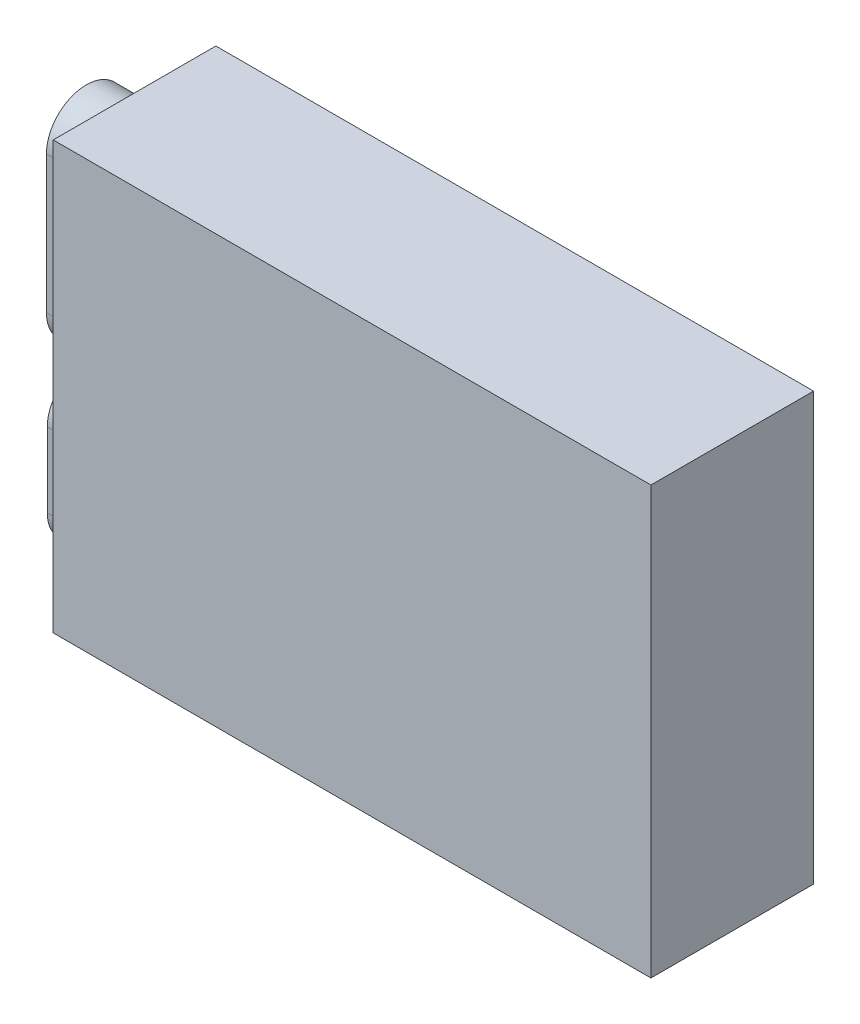
ISO-10303-21;
HEADER;
FILE_DESCRIPTION(('STEP AP214'),'2;1');
FILE_NAME('part.step','',(''),(''),'','','');
FILE_SCHEMA(('AUTOMOTIVE_DESIGN { 1 0 10303 214 1 1 1 1 }'));
ENDSEC;
DATA;
#1=APPLICATION_CONTEXT('core data for automotive mechanical design processes');
#2=APPLICATION_PROTOCOL_DEFINITION('international standard','automotive_design',2000,#1);
#3=PRODUCT_CONTEXT('',#1,'mechanical');
#4=PRODUCT('Part','Part','',(#3));
#5=PRODUCT_RELATED_PRODUCT_CATEGORY('part','',(#4));
#6=PRODUCT_DEFINITION_FORMATION('','',#4);
#7=PRODUCT_DEFINITION_CONTEXT('part definition',#1,'design');
#8=PRODUCT_DEFINITION('design','',#6,#7);
#9=PRODUCT_DEFINITION_SHAPE('','',#8);
#10=(LENGTH_UNIT() NAMED_UNIT(*) SI_UNIT(.MILLI.,.METRE.));
#11=(NAMED_UNIT(*) PLANE_ANGLE_UNIT() SI_UNIT($,.RADIAN.));
#12=(NAMED_UNIT(*) SI_UNIT($,.STERADIAN.) SOLID_ANGLE_UNIT());
#13=UNCERTAINTY_MEASURE_WITH_UNIT(LENGTH_MEASURE(1.E-05),#10,'distance_accuracy_value','');
#14=(GEOMETRIC_REPRESENTATION_CONTEXT(3) GLOBAL_UNCERTAINTY_ASSIGNED_CONTEXT((#13)) GLOBAL_UNIT_ASSIGNED_CONTEXT((#10,
#11,#12)) REPRESENTATION_CONTEXT('',''));
#15=CARTESIAN_POINT('',(0.,0.,0.));
#16=DIRECTION('',(0.,0.,1.));
#17=DIRECTION('',(1.,0.,0.));
#18=AXIS2_PLACEMENT_3D('',#15,#16,#17);
#19=CARTESIAN_POINT('',(-73.500000000001,-52.5000000000003,40.));
#20=DIRECTION('',(1.,0.,0.));
#21=DIRECTION('',(0.,0.,-1.));
#22=AXIS2_PLACEMENT_3D('',#19,#20,#21);
#23=PLANE('',#22);
#24=CARTESIAN_POINT('',(-73.500000000001,3.85949789173359,19.165513969355));
#25=DIRECTION('',(-1.,0.,0.));
#26=DIRECTION('',(0.,0.,1.));
#27=AXIS2_PLACEMENT_3D('',#24,#25,#26);
#28=CIRCLE('',#27,9.80521086007927);
#29=CARTESIAN_POINT('',(-73.500000000001,3.85949789173359,9.36030310927569));
#30=VERTEX_POINT('',#29);
#31=CARTESIAN_POINT('',(-73.500000000001,3.85949789173359,28.9707248294342));
#32=VERTEX_POINT('',#31);
#33=EDGE_CURVE('E262',#30,#32,#28,.T.);
#34=ORIENTED_EDGE('',*,*,#33,.F.);
#35=DIRECTION('',(0.,-1.,0.));
#36=VECTOR('',#35,1.);
#37=CARTESIAN_POINT('',(-73.500000000001,3.85949789173359,9.36030310927569));
#38=LINE('',#37,#36);
#39=CARTESIAN_POINT('',(-73.500000000001,37.6561821328578,9.36030310927569));
#40=VERTEX_POINT('',#39);
#41=EDGE_CURVE('E273',#40,#30,#38,.T.);
#42=ORIENTED_EDGE('',*,*,#41,.F.);
#43=CARTESIAN_POINT('',(-73.500000000001,37.6561821328578,19.165513969355));
#44=DIRECTION('',(-1.,0.,0.));
#45=DIRECTION('',(0.,0.,1.));
#46=AXIS2_PLACEMENT_3D('',#43,#44,#45);
#47=CIRCLE('',#46,9.80521086007927);
#48=CARTESIAN_POINT('',(-73.500000000001,37.6561821328578,28.9707248294342));
#49=VERTEX_POINT('',#48);
#50=EDGE_CURVE('E285',#49,#40,#47,.T.);
#51=ORIENTED_EDGE('',*,*,#50,.F.);
#52=DIRECTION('',(0.,1.,0.));
#53=VECTOR('',#52,1.);
#54=CARTESIAN_POINT('',(-73.500000000001,3.85949789173359,28.9707248294342));
#55=LINE('',#54,#53);
#56=EDGE_CURVE('E282',#32,#49,#55,.T.);
#57=ORIENTED_EDGE('',*,*,#56,.F.);
#58=EDGE_LOOP('',(#34,#42,#51,#57));
#59=FACE_BOUND('',#58,.T.);
#60=DIRECTION('',(0.,-1.,0.));
#61=VECTOR('',#60,1.);
#62=CARTESIAN_POINT('',(-73.500000000001,-52.5000000000003,0.));
#63=LINE('',#62,#61);
#64=CARTESIAN_POINT('',(-73.500000000001,52.4999999999997,0.));
#65=VERTEX_POINT('',#64);
#66=CARTESIAN_POINT('',(-73.500000000001,-52.5000000000003,0.));
#67=VERTEX_POINT('',#66);
#68=EDGE_CURVE('E301',#65,#67,#63,.T.);
#69=ORIENTED_EDGE('',*,*,#68,.T.);
#70=DIRECTION('',(0.,0.,-1.));
#71=VECTOR('',#70,1.);
#72=CARTESIAN_POINT('',(-73.500000000001,-52.5000000000003,40.));
#73=LINE('',#72,#71);
#74=CARTESIAN_POINT('',(-73.500000000001,-52.5000000000003,40.));
#75=VERTEX_POINT('',#74);
#76=EDGE_CURVE('E11',#75,#67,#73,.T.);
#77=ORIENTED_EDGE('',*,*,#76,.F.);
#78=DIRECTION('',(0.,-1.,0.));
#79=VECTOR('',#78,1.);
#80=CARTESIAN_POINT('',(-73.500000000001,-52.5000000000003,40.));
#81=LINE('',#80,#79);
#82=CARTESIAN_POINT('',(-73.500000000001,52.4999999999997,40.));
#83=VERTEX_POINT('',#82);
#84=EDGE_CURVE('E302',#83,#75,#81,.T.);
#85=ORIENTED_EDGE('',*,*,#84,.F.);
#86=DIRECTION('',(0.,0.,-1.));
#87=VECTOR('',#86,1.);
#88=CARTESIAN_POINT('',(-73.500000000001,52.4999999999997,40.));
#89=LINE('',#88,#87);
#90=EDGE_CURVE('E312',#83,#65,#89,.T.);
#91=ORIENTED_EDGE('',*,*,#90,.T.);
#92=EDGE_LOOP('',(#69,#77,#85,#91));
#93=FACE_BOUND('',#92,.T.);
#94=CARTESIAN_POINT('',(-73.500000000001,-38.9079111788249,19.5827569846775));
#95=DIRECTION('',(-1.,0.,0.));
#96=DIRECTION('',(0.,0.,1.));
#97=AXIS2_PLACEMENT_3D('',#94,#95,#96);
#98=CIRCLE('',#97,9.17934633709544);
#99=CARTESIAN_POINT('',(-73.500000000001,-38.9079111788249,10.403410647582));
#100=VERTEX_POINT('',#99);
#101=CARTESIAN_POINT('',(-73.500000000001,-38.9079111788249,28.7621033217729));
#102=VERTEX_POINT('',#101);
#103=EDGE_CURVE('E203',#100,#102,#98,.T.);
#104=ORIENTED_EDGE('',*,*,#103,.F.);
#105=DIRECTION('',(0.,-1.,0.));
#106=VECTOR('',#105,1.);
#107=CARTESIAN_POINT('',(-73.500000000001,-38.9079111788249,10.403410647582));
#108=LINE('',#107,#106);
#109=CARTESIAN_POINT('',(-73.500000000001,-20.5492185046339,10.403410647582));
#110=VERTEX_POINT('',#109);
#111=EDGE_CURVE('E211',#110,#100,#108,.T.);
#112=ORIENTED_EDGE('',*,*,#111,.F.);
#113=CARTESIAN_POINT('',(-73.500000000001,-20.5492185046339,19.5827569846775));
#114=DIRECTION('',(-1.,0.,0.));
#115=DIRECTION('',(0.,0.,1.));
#116=AXIS2_PLACEMENT_3D('',#113,#114,#115);
#117=CIRCLE('',#116,9.17934633709544);
#118=CARTESIAN_POINT('',(-73.500000000001,-20.5492185046339,28.7621033217729));
#119=VERTEX_POINT('',#118);
#120=EDGE_CURVE('E221',#119,#110,#117,.T.);
#121=ORIENTED_EDGE('',*,*,#120,.F.);
#122=DIRECTION('',(0.,1.,0.));
#123=VECTOR('',#122,1.);
#124=CARTESIAN_POINT('',(-73.500000000001,-38.9079111788249,28.7621033217729));
#125=LINE('',#124,#123);
#126=EDGE_CURVE('E54',#102,#119,#125,.T.);
#127=ORIENTED_EDGE('',*,*,#126,.F.);
#128=EDGE_LOOP('',(#104,#112,#121,#127));
#129=FACE_BOUND('',#128,.T.);
#130=ADVANCED_FACE('F32',(#59,#93,#129),#23,.F.);
#131=CARTESIAN_POINT('',(73.4999999999988,-52.5000000000002,40.));
#132=DIRECTION('',(0.,1.,0.));
#133=DIRECTION('',(-1.,0.,0.));
#134=AXIS2_PLACEMENT_3D('',#131,#132,#133);
#135=PLANE('',#134);
#136=DIRECTION('',(1.,0.,0.));
#137=VECTOR('',#136,1.);
#138=CARTESIAN_POINT('',(73.4999999999988,-52.5000000000002,0.));
#139=LINE('',#138,#137);
#140=CARTESIAN_POINT('',(73.4999999999988,-52.5000000000002,0.));
#141=VERTEX_POINT('',#140);
#142=EDGE_CURVE('E315',#67,#141,#139,.T.);
#143=ORIENTED_EDGE('',*,*,#142,.T.);
#144=DIRECTION('',(0.,0.,-1.));
#145=VECTOR('',#144,1.);
#146=CARTESIAN_POINT('',(73.4999999999988,-52.5000000000002,40.));
#147=LINE('',#146,#145);
#148=CARTESIAN_POINT('',(73.4999999999988,-52.5000000000002,40.));
#149=VERTEX_POINT('',#148);
#150=EDGE_CURVE('E39',#149,#141,#147,.T.);
#151=ORIENTED_EDGE('',*,*,#150,.F.);
#152=DIRECTION('',(1.,0.,0.));
#153=VECTOR('',#152,1.);
#154=CARTESIAN_POINT('',(73.4999999999988,-52.5000000000002,40.));
#155=LINE('',#154,#153);
#156=EDGE_CURVE('E305',#75,#149,#155,.T.);
#157=ORIENTED_EDGE('',*,*,#156,.F.);
#158=ORIENTED_EDGE('',*,*,#76,.T.);
#159=EDGE_LOOP('',(#143,#151,#157,#158));
#160=FACE_BOUND('',#159,.T.);
#161=ADVANCED_FACE('F345',(#160),#135,.F.);
#162=CARTESIAN_POINT('',(73.4999999999988,-52.5000000000002,40.));
#163=DIRECTION('',(-1.,0.,0.));
#164=DIRECTION('',(0.,0.,1.));
#165=AXIS2_PLACEMENT_3D('',#162,#163,#164);
#166=PLANE('',#165);
#167=DIRECTION('',(0.,1.,0.));
#168=VECTOR('',#167,1.);
#169=CARTESIAN_POINT('',(73.4999999999988,-52.5000000000002,0.));
#170=LINE('',#169,#168);
#171=CARTESIAN_POINT('',(73.4999999999988,52.4999999999998,0.));
#172=VERTEX_POINT('',#171);
#173=EDGE_CURVE('E317',#141,#172,#170,.T.);
#174=ORIENTED_EDGE('',*,*,#173,.T.);
#175=DIRECTION('',(0.,0.,-1.));
#176=VECTOR('',#175,1.);
#177=CARTESIAN_POINT('',(73.4999999999988,52.4999999999998,40.));
#178=LINE('',#177,#176);
#179=CARTESIAN_POINT('',(73.4999999999988,52.4999999999998,40.));
#180=VERTEX_POINT('',#179);
#181=EDGE_CURVE('E322',#180,#172,#178,.T.);
#182=ORIENTED_EDGE('',*,*,#181,.F.);
#183=DIRECTION('',(0.,1.,0.));
#184=VECTOR('',#183,1.);
#185=CARTESIAN_POINT('',(73.4999999999988,-52.5000000000002,40.));
#186=LINE('',#185,#184);
#187=EDGE_CURVE('E308',#149,#180,#186,.T.);
#188=ORIENTED_EDGE('',*,*,#187,.F.);
#189=ORIENTED_EDGE('',*,*,#150,.T.);
#190=EDGE_LOOP('',(#174,#182,#188,#189));
#191=FACE_BOUND('',#190,.T.);
#192=ADVANCED_FACE('F329',(#191),#166,.F.);
#193=CARTESIAN_POINT('',(73.4999999999988,52.4999999999998,40.));
#194=DIRECTION('',(0.,-1.,0.));
#195=DIRECTION('',(1.,0.,0.));
#196=AXIS2_PLACEMENT_3D('',#193,#194,#195);
#197=PLANE('',#196);
#198=DIRECTION('',(-1.,0.,0.));
#199=VECTOR('',#198,1.);
#200=CARTESIAN_POINT('',(73.4999999999988,52.4999999999998,0.));
#201=LINE('',#200,#199);
#202=EDGE_CURVE('E306',#172,#65,#201,.T.);
#203=ORIENTED_EDGE('',*,*,#202,.T.);
#204=ORIENTED_EDGE('',*,*,#90,.F.);
#205=DIRECTION('',(-1.,0.,0.));
#206=VECTOR('',#205,1.);
#207=CARTESIAN_POINT('',(73.4999999999988,52.4999999999998,40.));
#208=LINE('',#207,#206);
#209=EDGE_CURVE('E310',#180,#83,#208,.T.);
#210=ORIENTED_EDGE('',*,*,#209,.F.);
#211=ORIENTED_EDGE('',*,*,#181,.T.);
#212=EDGE_LOOP('',(#203,#204,#210,#211));
#213=FACE_BOUND('',#212,.T.);
#214=ADVANCED_FACE('F338',(#213),#197,.F.);
#215=CARTESIAN_POINT('',(0.,0.,40.));
#216=DIRECTION('',(0.,0.,1.));
#217=DIRECTION('',(1.,0.,0.));
#218=AXIS2_PLACEMENT_3D('',#215,#216,#217);
#219=PLANE('',#218);
#220=ORIENTED_EDGE('',*,*,#84,.T.);
#221=ORIENTED_EDGE('',*,*,#156,.T.);
#222=ORIENTED_EDGE('',*,*,#187,.T.);
#223=ORIENTED_EDGE('',*,*,#209,.T.);
#224=EDGE_LOOP('',(#220,#221,#222,#223));
#225=FACE_BOUND('',#224,.T.);
#226=ADVANCED_FACE('F344',(#225),#219,.T.);
#227=CARTESIAN_POINT('',(0.,0.,0.));
#228=DIRECTION('',(0.,0.,1.));
#229=DIRECTION('',(1.,0.,0.));
#230=AXIS2_PLACEMENT_3D('',#227,#228,#229);
#231=PLANE('',#230);
#232=ORIENTED_EDGE('',*,*,#68,.F.);
#233=ORIENTED_EDGE('',*,*,#202,.F.);
#234=ORIENTED_EDGE('',*,*,#173,.F.);
#235=ORIENTED_EDGE('',*,*,#142,.F.);
#236=EDGE_LOOP('',(#232,#233,#234,#235));
#237=FACE_BOUND('',#236,.T.);
#238=ADVANCED_FACE('F335',(#237),#231,.F.);
#239=CARTESIAN_POINT('',(-86.200000000001,3.85949789173359,19.165513969355));
#240=DIRECTION('',(1.,0.,0.));
#241=DIRECTION('',(0.,0.,-1.));
#242=AXIS2_PLACEMENT_3D('',#239,#240,#241);
#243=CYLINDRICAL_SURFACE('',#242,9.80521086007927);
#244=ORIENTED_EDGE('',*,*,#33,.T.);
#245=DIRECTION('',(1.,0.,0.));
#246=VECTOR('',#245,1.);
#247=CARTESIAN_POINT('',(-86.200000000001,3.85949789173359,28.9707248294342));
#248=LINE('',#247,#246);
#249=CARTESIAN_POINT('',(-86.200000000001,3.85949789173359,28.9707248294342));
#250=VERTEX_POINT('',#249);
#251=EDGE_CURVE('E298',#250,#32,#248,.T.);
#252=ORIENTED_EDGE('',*,*,#251,.F.);
#253=CARTESIAN_POINT('',(-86.200000000001,3.85949789173359,19.165513969355));
#254=DIRECTION('',(-1.,0.,0.));
#255=DIRECTION('',(0.,0.,1.));
#256=AXIS2_PLACEMENT_3D('',#253,#254,#255);
#257=CIRCLE('',#256,9.80521086007927);
#258=CARTESIAN_POINT('',(-86.200000000001,3.85949789173359,9.36030310927569));
#259=VERTEX_POINT('',#258);
#260=EDGE_CURVE('E269',#259,#250,#257,.T.);
#261=ORIENTED_EDGE('',*,*,#260,.F.);
#262=DIRECTION('',(1.,0.,0.));
#263=VECTOR('',#262,1.);
#264=CARTESIAN_POINT('',(-86.200000000001,3.85949789173359,9.36030310927569));
#265=LINE('',#264,#263);
#266=EDGE_CURVE('E279',#259,#30,#265,.T.);
#267=ORIENTED_EDGE('',*,*,#266,.T.);
#268=EDGE_LOOP('',(#244,#252,#261,#267));
#269=FACE_BOUND('',#268,.T.);
#270=ADVANCED_FACE('F358',(#269),#243,.T.);
#271=CARTESIAN_POINT('',(-86.200000000001,3.85949789173359,28.9707248294342));
#272=DIRECTION('',(0.,0.,-1.));
#273=DIRECTION('',(-1.,0.,0.));
#274=AXIS2_PLACEMENT_3D('',#271,#272,#273);
#275=PLANE('',#274);
#276=ORIENTED_EDGE('',*,*,#56,.T.);
#277=DIRECTION('',(1.,0.,0.));
#278=VECTOR('',#277,1.);
#279=CARTESIAN_POINT('',(-86.200000000001,37.6561821328578,28.9707248294342));
#280=LINE('',#279,#278);
#281=CARTESIAN_POINT('',(-86.200000000001,37.6561821328578,28.9707248294342));
#282=VERTEX_POINT('',#281);
#283=EDGE_CURVE('E295',#282,#49,#280,.T.);
#284=ORIENTED_EDGE('',*,*,#283,.F.);
#285=DIRECTION('',(0.,1.,0.));
#286=VECTOR('',#285,1.);
#287=CARTESIAN_POINT('',(-86.200000000001,3.85949789173359,28.9707248294342));
#288=LINE('',#287,#286);
#289=EDGE_CURVE('E272',#250,#282,#288,.T.);
#290=ORIENTED_EDGE('',*,*,#289,.F.);
#291=ORIENTED_EDGE('',*,*,#251,.T.);
#292=EDGE_LOOP('',(#276,#284,#290,#291));
#293=FACE_BOUND('',#292,.T.);
#294=ADVANCED_FACE('F363',(#293),#275,.F.);
#295=CARTESIAN_POINT('',(-86.200000000001,37.6561821328578,19.165513969355));
#296=DIRECTION('',(1.,0.,0.));
#297=DIRECTION('',(0.,0.,-1.));
#298=AXIS2_PLACEMENT_3D('',#295,#296,#297);
#299=CYLINDRICAL_SURFACE('',#298,9.80521086007927);
#300=ORIENTED_EDGE('',*,*,#50,.T.);
#301=DIRECTION('',(1.,0.,0.));
#302=VECTOR('',#301,1.);
#303=CARTESIAN_POINT('',(-86.200000000001,37.6561821328578,9.36030310927569));
#304=LINE('',#303,#302);
#305=CARTESIAN_POINT('',(-86.200000000001,37.6561821328578,9.36030310927569));
#306=VERTEX_POINT('',#305);
#307=EDGE_CURVE('E292',#306,#40,#304,.T.);
#308=ORIENTED_EDGE('',*,*,#307,.F.);
#309=CARTESIAN_POINT('',(-86.200000000001,37.6561821328578,19.165513969355));
#310=DIRECTION('',(-1.,0.,0.));
#311=DIRECTION('',(0.,0.,1.));
#312=AXIS2_PLACEMENT_3D('',#309,#310,#311);
#313=CIRCLE('',#312,9.80521086007927);
#314=EDGE_CURVE('E275',#282,#306,#313,.T.);
#315=ORIENTED_EDGE('',*,*,#314,.F.);
#316=ORIENTED_EDGE('',*,*,#283,.T.);
#317=EDGE_LOOP('',(#300,#308,#315,#316));
#318=FACE_BOUND('',#317,.T.);
#319=ADVANCED_FACE('F367',(#318),#299,.T.);
#320=CARTESIAN_POINT('',(-86.200000000001,3.85949789173359,9.36030310927569));
#321=DIRECTION('',(0.,0.,1.));
#322=DIRECTION('',(1.,0.,0.));
#323=AXIS2_PLACEMENT_3D('',#320,#321,#322);
#324=PLANE('',#323);
#325=ORIENTED_EDGE('',*,*,#41,.T.);
#326=ORIENTED_EDGE('',*,*,#266,.F.);
#327=DIRECTION('',(0.,-1.,0.));
#328=VECTOR('',#327,1.);
#329=CARTESIAN_POINT('',(-86.200000000001,3.85949789173359,9.36030310927569));
#330=LINE('',#329,#328);
#331=EDGE_CURVE('E277',#306,#259,#330,.T.);
#332=ORIENTED_EDGE('',*,*,#331,.F.);
#333=ORIENTED_EDGE('',*,*,#307,.T.);
#334=EDGE_LOOP('',(#325,#326,#332,#333));
#335=FACE_BOUND('',#334,.T.);
#336=ADVANCED_FACE('F371',(#335),#324,.F.);
#337=CARTESIAN_POINT('',(-86.200000000001,3.85949789173359,19.165513969355));
#338=DIRECTION('',(-1.,0.,0.));
#339=DIRECTION('',(0.,0.,1.));
#340=AXIS2_PLACEMENT_3D('',#337,#338,#339);
#341=PLANE('',#340);
#342=CARTESIAN_POINT('',(-86.200000000001,3.85949789173359,19.569921541134));
#343=DIRECTION('',(-1.,0.,0.));
#344=DIRECTION('',(0.,0.,1.));
#345=AXIS2_PLACEMENT_3D('',#342,#343,#344);
#346=CIRCLE('',#345,7.41605218116661);
#347=CARTESIAN_POINT('',(-86.200000000001,3.77076454303128,12.1544002279279));
#348=VERTEX_POINT('',#347);
#349=CARTESIAN_POINT('',(-86.200000000001,3.9482312404359,26.9854428543401));
#350=VERTEX_POINT('',#349);
#351=EDGE_CURVE('E236',#348,#350,#346,.T.);
#352=ORIENTED_EDGE('',*,*,#351,.F.);
#353=DIRECTION('',(0.,-0.999928416366615,0.01196503834313));
#354=VECTOR('',#353,1.);
#355=CARTESIAN_POINT('',(-86.200000000001,3.77076454303128,12.1544002279279));
#356=LINE('',#355,#354);
#357=CARTESIAN_POINT('',(-86.200000000001,37.5674487841555,11.7499926561488));
#358=VERTEX_POINT('',#357);
#359=EDGE_CURVE('E241',#358,#348,#356,.T.);
#360=ORIENTED_EDGE('',*,*,#359,.F.);
#361=CARTESIAN_POINT('',(-86.200000000001,37.6561821328578,19.165513969355));
#362=DIRECTION('',(-1.,0.,0.));
#363=DIRECTION('',(0.,0.,1.));
#364=AXIS2_PLACEMENT_3D('',#361,#362,#363);
#365=CIRCLE('',#364,7.41605218116661);
#366=CARTESIAN_POINT('',(-86.200000000001,37.7449154815601,26.5810352825611));
#367=VERTEX_POINT('',#366);
#368=EDGE_CURVE('E255',#367,#358,#365,.T.);
#369=ORIENTED_EDGE('',*,*,#368,.F.);
#370=DIRECTION('',(0.,0.999928416366615,-0.01196503834313));
#371=VECTOR('',#370,1.);
#372=CARTESIAN_POINT('',(-86.200000000001,3.9482312404359,26.9854428543401));
#373=LINE('',#372,#371);
#374=EDGE_CURVE('E252',#350,#367,#373,.T.);
#375=ORIENTED_EDGE('',*,*,#374,.F.);
#376=EDGE_LOOP('',(#352,#360,#369,#375));
#377=FACE_BOUND('',#376,.T.);
#378=ORIENTED_EDGE('',*,*,#260,.T.);
#379=ORIENTED_EDGE('',*,*,#289,.T.);
#380=ORIENTED_EDGE('',*,*,#314,.T.);
#381=ORIENTED_EDGE('',*,*,#331,.T.);
#382=EDGE_LOOP('',(#378,#379,#380,#381));
#383=FACE_BOUND('',#382,.T.);
#384=ADVANCED_FACE('F375',(#377,#383),#341,.T.);
#385=CARTESIAN_POINT('',(-76.040000000001,3.85949789173359,19.569921541134));
#386=DIRECTION('',(-1.,0.,0.));
#387=DIRECTION('',(0.,0.,1.));
#388=AXIS2_PLACEMENT_3D('',#385,#386,#387);
#389=CYLINDRICAL_SURFACE('',#388,7.41605218116661);
#390=ORIENTED_EDGE('',*,*,#351,.T.);
#391=DIRECTION('',(-1.,0.,0.));
#392=VECTOR('',#391,1.);
#393=CARTESIAN_POINT('',(-76.040000000001,3.9482312404359,26.9854428543401));
#394=LINE('',#393,#392);
#395=CARTESIAN_POINT('',(-76.040000000001,3.9482312404359,26.9854428543401));
#396=VERTEX_POINT('',#395);
#397=EDGE_CURVE('E250',#396,#350,#394,.T.);
#398=ORIENTED_EDGE('',*,*,#397,.F.);
#399=CARTESIAN_POINT('',(-76.040000000001,3.85949789173359,19.569921541134));
#400=DIRECTION('',(-1.,0.,0.));
#401=DIRECTION('',(0.,0.,1.));
#402=AXIS2_PLACEMENT_3D('',#399,#400,#401);
#403=CIRCLE('',#402,7.41605218116661);
#404=CARTESIAN_POINT('',(-76.040000000001,3.77076454303128,12.1544002279279));
#405=VERTEX_POINT('',#404);
#406=EDGE_CURVE('E237',#405,#396,#403,.T.);
#407=ORIENTED_EDGE('',*,*,#406,.F.);
#408=DIRECTION('',(-1.,0.,0.));
#409=VECTOR('',#408,1.);
#410=CARTESIAN_POINT('',(-76.040000000001,3.77076454303128,12.1544002279279));
#411=LINE('',#410,#409);
#412=EDGE_CURVE('E260',#405,#348,#411,.T.);
#413=ORIENTED_EDGE('',*,*,#412,.T.);
#414=EDGE_LOOP('',(#390,#398,#407,#413));
#415=FACE_BOUND('',#414,.T.);
#416=ADVANCED_FACE('F379',(#415),#389,.F.);
#417=CARTESIAN_POINT('',(-76.040000000001,3.77076454303128,12.1544002279279));
#418=DIRECTION('',(0.,-0.01196503834313,-0.999928416366615));
#419=DIRECTION('',(0.,0.999928416366615,-0.01196503834313));
#420=AXIS2_PLACEMENT_3D('',#417,#418,#419);
#421=PLANE('',#420);
#422=ORIENTED_EDGE('',*,*,#359,.T.);
#423=ORIENTED_EDGE('',*,*,#412,.F.);
#424=DIRECTION('',(0.,-0.999928416366615,0.01196503834313));
#425=VECTOR('',#424,1.);
#426=CARTESIAN_POINT('',(-76.040000000001,3.77076454303128,12.1544002279279));
#427=LINE('',#426,#425);
#428=CARTESIAN_POINT('',(-76.040000000001,37.5674487841555,11.7499926561488));
#429=VERTEX_POINT('',#428);
#430=EDGE_CURVE('E247',#429,#405,#427,.T.);
#431=ORIENTED_EDGE('',*,*,#430,.F.);
#432=DIRECTION('',(-1.,0.,0.));
#433=VECTOR('',#432,1.);
#434=CARTESIAN_POINT('',(-76.040000000001,37.5674487841555,11.7499926561488));
#435=LINE('',#434,#433);
#436=EDGE_CURVE('E263',#429,#358,#435,.T.);
#437=ORIENTED_EDGE('',*,*,#436,.T.);
#438=EDGE_LOOP('',(#422,#423,#431,#437));
#439=FACE_BOUND('',#438,.T.);
#440=ADVANCED_FACE('F383',(#439),#421,.F.);
#441=CARTESIAN_POINT('',(-76.040000000001,37.6561821328578,19.165513969355));
#442=DIRECTION('',(-1.,0.,0.));
#443=DIRECTION('',(0.,0.,1.));
#444=AXIS2_PLACEMENT_3D('',#441,#442,#443);
#445=CYLINDRICAL_SURFACE('',#444,7.41605218116661);
#446=ORIENTED_EDGE('',*,*,#368,.T.);
#447=ORIENTED_EDGE('',*,*,#436,.F.);
#448=CARTESIAN_POINT('',(-76.040000000001,37.6561821328578,19.165513969355));
#449=DIRECTION('',(-1.,0.,0.));
#450=DIRECTION('',(0.,0.,1.));
#451=AXIS2_PLACEMENT_3D('',#448,#449,#450);
#452=CIRCLE('',#451,7.41605218116661);
#453=CARTESIAN_POINT('',(-76.040000000001,37.7449154815601,26.5810352825611));
#454=VERTEX_POINT('',#453);
#455=EDGE_CURVE('E244',#454,#429,#452,.T.);
#456=ORIENTED_EDGE('',*,*,#455,.F.);
#457=DIRECTION('',(-1.,0.,0.));
#458=VECTOR('',#457,1.);
#459=CARTESIAN_POINT('',(-76.040000000001,37.7449154815601,26.5810352825611));
#460=LINE('',#459,#458);
#461=EDGE_CURVE('E265',#454,#367,#460,.T.);
#462=ORIENTED_EDGE('',*,*,#461,.T.);
#463=EDGE_LOOP('',(#446,#447,#456,#462));
#464=FACE_BOUND('',#463,.T.);
#465=ADVANCED_FACE('F389',(#464),#445,.F.);
#466=CARTESIAN_POINT('',(-76.040000000001,3.9482312404359,26.9854428543401));
#467=DIRECTION('',(0.,0.01196503834313,0.999928416366615));
#468=DIRECTION('',(0.,-0.999928416366615,0.01196503834313));
#469=AXIS2_PLACEMENT_3D('',#466,#467,#468);
#470=PLANE('',#469);
#471=ORIENTED_EDGE('',*,*,#374,.T.);
#472=ORIENTED_EDGE('',*,*,#461,.F.);
#473=DIRECTION('',(0.,0.999928416366615,-0.01196503834313));
#474=VECTOR('',#473,1.);
#475=CARTESIAN_POINT('',(-76.040000000001,3.9482312404359,26.9854428543401));
#476=LINE('',#475,#474);
#477=EDGE_CURVE('E240',#396,#454,#476,.T.);
#478=ORIENTED_EDGE('',*,*,#477,.F.);
#479=ORIENTED_EDGE('',*,*,#397,.T.);
#480=EDGE_LOOP('',(#471,#472,#478,#479));
#481=FACE_BOUND('',#480,.T.);
#482=ADVANCED_FACE('F385',(#481),#470,.F.);
#483=CARTESIAN_POINT('',(-76.040000000001,3.85949789173359,19.569921541134));
#484=DIRECTION('',(-1.,0.,0.));
#485=DIRECTION('',(0.,0.,1.));
#486=AXIS2_PLACEMENT_3D('',#483,#484,#485);
#487=PLANE('',#486);
#488=ORIENTED_EDGE('',*,*,#406,.T.);
#489=ORIENTED_EDGE('',*,*,#477,.T.);
#490=ORIENTED_EDGE('',*,*,#455,.T.);
#491=ORIENTED_EDGE('',*,*,#430,.T.);
#492=EDGE_LOOP('',(#488,#489,#490,#491));
#493=FACE_BOUND('',#492,.T.);
#494=ADVANCED_FACE('F388',(#493),#487,.T.);
#495=CARTESIAN_POINT('',(-86.200000000001,-38.9079111788249,19.5827569846775));
#496=DIRECTION('',(1.,0.,0.));
#497=DIRECTION('',(0.,0.,-1.));
#498=AXIS2_PLACEMENT_3D('',#495,#496,#497);
#499=CYLINDRICAL_SURFACE('',#498,9.17934633709544);
#500=ORIENTED_EDGE('',*,*,#103,.T.);
#501=DIRECTION('',(1.,0.,0.));
#502=VECTOR('',#501,1.);
#503=CARTESIAN_POINT('',(-86.200000000001,-38.9079111788249,28.7621033217729));
#504=LINE('',#503,#502);
#505=CARTESIAN_POINT('',(-86.200000000001,-38.9079111788249,28.7621033217729));
#506=VERTEX_POINT('',#505);
#507=EDGE_CURVE('E234',#506,#102,#504,.T.);
#508=ORIENTED_EDGE('',*,*,#507,.F.);
#509=CARTESIAN_POINT('',(-86.200000000001,-38.9079111788249,19.5827569846775));
#510=DIRECTION('',(-1.,0.,0.));
#511=DIRECTION('',(0.,0.,1.));
#512=AXIS2_PLACEMENT_3D('',#509,#510,#511);
#513=CIRCLE('',#512,9.17934633709544);
#514=CARTESIAN_POINT('',(-86.200000000001,-38.9079111788249,10.403410647582));
#515=VERTEX_POINT('',#514);
#516=EDGE_CURVE('E207',#515,#506,#513,.T.);
#517=ORIENTED_EDGE('',*,*,#516,.F.);
#518=DIRECTION('',(1.,0.,0.));
#519=VECTOR('',#518,1.);
#520=CARTESIAN_POINT('',(-86.200000000001,-38.9079111788249,10.403410647582));
#521=LINE('',#520,#519);
#522=EDGE_CURVE('E217',#515,#100,#521,.T.);
#523=ORIENTED_EDGE('',*,*,#522,.T.);
#524=EDGE_LOOP('',(#500,#508,#517,#523));
#525=FACE_BOUND('',#524,.T.);
#526=ADVANCED_FACE('F399',(#525),#499,.T.);
#527=CARTESIAN_POINT('',(-86.200000000001,-38.9079111788249,28.7621033217729));
#528=DIRECTION('',(0.,0.,-1.));
#529=DIRECTION('',(-1.,0.,0.));
#530=AXIS2_PLACEMENT_3D('',#527,#528,#529);
#531=PLANE('',#530);
#532=ORIENTED_EDGE('',*,*,#126,.T.);
#533=DIRECTION('',(1.,0.,0.));
#534=VECTOR('',#533,1.);
#535=CARTESIAN_POINT('',(-86.200000000001,-20.5492185046339,28.7621033217729));
#536=LINE('',#535,#534);
#537=CARTESIAN_POINT('',(-86.200000000001,-20.5492185046339,28.7621033217729));
#538=VERTEX_POINT('',#537);
#539=EDGE_CURVE('E231',#538,#119,#536,.T.);
#540=ORIENTED_EDGE('',*,*,#539,.F.);
#541=DIRECTION('',(0.,1.,0.));
#542=VECTOR('',#541,1.);
#543=CARTESIAN_POINT('',(-86.200000000001,-38.9079111788249,28.7621033217729));
#544=LINE('',#543,#542);
#545=EDGE_CURVE('E210',#506,#538,#544,.T.);
#546=ORIENTED_EDGE('',*,*,#545,.F.);
#547=ORIENTED_EDGE('',*,*,#507,.T.);
#548=EDGE_LOOP('',(#532,#540,#546,#547));
#549=FACE_BOUND('',#548,.T.);
#550=ADVANCED_FACE('F403',(#549),#531,.F.);
#551=CARTESIAN_POINT('',(-86.200000000001,-20.5492185046339,19.5827569846775));
#552=DIRECTION('',(1.,0.,0.));
#553=DIRECTION('',(0.,0.,-1.));
#554=AXIS2_PLACEMENT_3D('',#551,#552,#553);
#555=CYLINDRICAL_SURFACE('',#554,9.17934633709544);
#556=ORIENTED_EDGE('',*,*,#120,.T.);
#557=DIRECTION('',(1.,0.,0.));
#558=VECTOR('',#557,1.);
#559=CARTESIAN_POINT('',(-86.200000000001,-20.5492185046339,10.403410647582));
#560=LINE('',#559,#558);
#561=CARTESIAN_POINT('',(-86.200000000001,-20.5492185046339,10.403410647582));
#562=VERTEX_POINT('',#561);
#563=EDGE_CURVE('E228',#562,#110,#560,.T.);
#564=ORIENTED_EDGE('',*,*,#563,.F.);
#565=CARTESIAN_POINT('',(-86.200000000001,-20.5492185046339,19.5827569846775));
#566=DIRECTION('',(-1.,0.,0.));
#567=DIRECTION('',(0.,0.,1.));
#568=AXIS2_PLACEMENT_3D('',#565,#566,#567);
#569=CIRCLE('',#568,9.17934633709544);
#570=EDGE_CURVE('E213',#538,#562,#569,.T.);
#571=ORIENTED_EDGE('',*,*,#570,.F.);
#572=ORIENTED_EDGE('',*,*,#539,.T.);
#573=EDGE_LOOP('',(#556,#564,#571,#572));
#574=FACE_BOUND('',#573,.T.);
#575=ADVANCED_FACE('F407',(#574),#555,.T.);
#576=CARTESIAN_POINT('',(-86.200000000001,-38.9079111788249,10.403410647582));
#577=DIRECTION('',(0.,0.,1.));
#578=DIRECTION('',(1.,0.,0.));
#579=AXIS2_PLACEMENT_3D('',#576,#577,#578);
#580=PLANE('',#579);
#581=ORIENTED_EDGE('',*,*,#111,.T.);
#582=ORIENTED_EDGE('',*,*,#522,.F.);
#583=DIRECTION('',(0.,-1.,0.));
#584=VECTOR('',#583,1.);
#585=CARTESIAN_POINT('',(-86.200000000001,-38.9079111788249,10.403410647582));
#586=LINE('',#585,#584);
#587=EDGE_CURVE('E215',#562,#515,#586,.T.);
#588=ORIENTED_EDGE('',*,*,#587,.F.);
#589=ORIENTED_EDGE('',*,*,#563,.T.);
#590=EDGE_LOOP('',(#581,#582,#588,#589));
#591=FACE_BOUND('',#590,.T.);
#592=ADVANCED_FACE('F411',(#591),#580,.F.);
#593=CARTESIAN_POINT('',(-86.200000000001,-38.9079111788249,19.5827569846775));
#594=DIRECTION('',(-1.,0.,0.));
#595=DIRECTION('',(0.,0.,1.));
#596=AXIS2_PLACEMENT_3D('',#593,#594,#595);
#597=PLANE('',#596);
#598=CARTESIAN_POINT('',(-86.200000000001,-38.9079111788249,19.6344692603229));
#599=DIRECTION('',(-1.,0.,0.));
#600=DIRECTION('',(0.,0.,1.));
#601=AXIS2_PLACEMENT_3D('',#598,#599,#600);
#602=CIRCLE('',#601,7.24622437330428);
#603=CARTESIAN_POINT('',(-86.200000000001,-38.928322069311,12.3882736333874));
#604=VERTEX_POINT('',#603);
#605=CARTESIAN_POINT('',(-86.200000000001,-38.8875002883388,26.8806648872583));
#606=VERTEX_POINT('',#605);
#607=EDGE_CURVE('E46',#604,#606,#602,.T.);
#608=ORIENTED_EDGE('',*,*,#607,.F.);
#609=DIRECTION('',(0.,-0.999996032917649,0.00281676214185156));
#610=VECTOR('',#609,1.);
#611=CARTESIAN_POINT('',(-86.200000000001,-38.928322069311,12.3882736333874));
#612=LINE('',#611,#610);
#613=CARTESIAN_POINT('',(-86.200000000001,-20.56962939512,12.336561357742));
#614=VERTEX_POINT('',#613);
#615=EDGE_CURVE('E188',#614,#604,#612,.T.);
#616=ORIENTED_EDGE('',*,*,#615,.F.);
#617=CARTESIAN_POINT('',(-86.200000000001,-20.5492185046339,19.5827569846775));
#618=DIRECTION('',(-1.,0.,0.));
#619=DIRECTION('',(0.,0.,1.));
#620=AXIS2_PLACEMENT_3D('',#617,#618,#619);
#621=CIRCLE('',#620,7.24622437330428);
#622=CARTESIAN_POINT('',(-86.200000000001,-20.5288076141478,26.8289526116129));
#623=VERTEX_POINT('',#622);
#624=EDGE_CURVE('E191',#623,#614,#621,.T.);
#625=ORIENTED_EDGE('',*,*,#624,.F.);
#626=DIRECTION('',(0.,0.999996032917649,-0.00281676214185156));
#627=VECTOR('',#626,1.);
#628=CARTESIAN_POINT('',(-86.200000000001,-38.8875002883388,26.8806648872583));
#629=LINE('',#628,#627);
#630=EDGE_CURVE('E197',#606,#623,#629,.T.);
#631=ORIENTED_EDGE('',*,*,#630,.F.);
#632=EDGE_LOOP('',(#608,#616,#625,#631));
#633=FACE_BOUND('',#632,.T.);
#634=ORIENTED_EDGE('',*,*,#516,.T.);
#635=ORIENTED_EDGE('',*,*,#545,.T.);
#636=ORIENTED_EDGE('',*,*,#570,.T.);
#637=ORIENTED_EDGE('',*,*,#587,.T.);
#638=EDGE_LOOP('',(#634,#635,#636,#637));
#639=FACE_BOUND('',#638,.T.);
#640=ADVANCED_FACE('F415',(#633,#639),#597,.T.);
#641=CARTESIAN_POINT('',(-76.040000000001,-38.9079111788249,19.6344692603229));
#642=DIRECTION('',(-1.,0.,0.));
#643=DIRECTION('',(0.,0.,1.));
#644=AXIS2_PLACEMENT_3D('',#641,#642,#643);
#645=CYLINDRICAL_SURFACE('',#644,7.24622437330428);
#646=ORIENTED_EDGE('',*,*,#607,.T.);
#647=DIRECTION('',(-1.,0.,0.));
#648=VECTOR('',#647,1.);
#649=CARTESIAN_POINT('',(-76.040000000001,-38.8875002883388,26.8806648872583));
#650=LINE('',#649,#648);
#651=CARTESIAN_POINT('',(-76.040000000001,-38.8875002883388,26.8806648872583));
#652=VERTEX_POINT('',#651);
#653=EDGE_CURVE('E166',#652,#606,#650,.T.);
#654=ORIENTED_EDGE('',*,*,#653,.F.);
#655=CARTESIAN_POINT('',(-76.040000000001,-38.9079111788249,19.6344692603229));
#656=DIRECTION('',(-1.,0.,0.));
#657=DIRECTION('',(0.,0.,1.));
#658=AXIS2_PLACEMENT_3D('',#655,#656,#657);
#659=CIRCLE('',#658,7.24622437330428);
#660=CARTESIAN_POINT('',(-76.040000000001,-38.928322069311,12.3882736333874));
#661=VERTEX_POINT('',#660);
#662=EDGE_CURVE('E170',#661,#652,#659,.T.);
#663=ORIENTED_EDGE('',*,*,#662,.F.);
#664=DIRECTION('',(-1.,0.,0.));
#665=VECTOR('',#664,1.);
#666=CARTESIAN_POINT('',(-76.040000000001,-38.928322069311,12.3882736333874));
#667=LINE('',#666,#665);
#668=EDGE_CURVE('E201',#661,#604,#667,.T.);
#669=ORIENTED_EDGE('',*,*,#668,.T.);
#670=EDGE_LOOP('',(#646,#654,#663,#669));
#671=FACE_BOUND('',#670,.T.);
#672=ADVANCED_FACE('F168',(#671),#645,.F.);
#673=CARTESIAN_POINT('',(-76.040000000001,-38.928322069311,12.3882736333874));
#674=DIRECTION('',(0.,-0.00281676214185156,-0.999996032917649));
#675=DIRECTION('',(0.,0.999996032917649,-0.00281676214185156));
#676=AXIS2_PLACEMENT_3D('',#673,#674,#675);
#677=PLANE('',#676);
#678=ORIENTED_EDGE('',*,*,#615,.T.);
#679=ORIENTED_EDGE('',*,*,#668,.F.);
#680=DIRECTION('',(0.,-0.999996032917649,0.00281676214185156));
#681=VECTOR('',#680,1.);
#682=CARTESIAN_POINT('',(-76.040000000001,-38.928322069311,12.3882736333874));
#683=LINE('',#682,#681);
#684=CARTESIAN_POINT('',(-76.040000000001,-20.56962939512,12.336561357742));
#685=VERTEX_POINT('',#684);
#686=EDGE_CURVE('E176',#685,#661,#683,.T.);
#687=ORIENTED_EDGE('',*,*,#686,.F.);
#688=DIRECTION('',(-1.,0.,0.));
#689=VECTOR('',#688,1.);
#690=CARTESIAN_POINT('',(-76.040000000001,-20.56962939512,12.336561357742));
#691=LINE('',#690,#689);
#692=EDGE_CURVE('E204',#685,#614,#691,.T.);
#693=ORIENTED_EDGE('',*,*,#692,.T.);
#694=EDGE_LOOP('',(#678,#679,#687,#693));
#695=FACE_BOUND('',#694,.T.);
#696=ADVANCED_FACE('F422',(#695),#677,.F.);
#697=CARTESIAN_POINT('',(-76.040000000001,-20.5492185046339,19.5827569846775));
#698=DIRECTION('',(-1.,0.,0.));
#699=DIRECTION('',(0.,0.,1.));
#700=AXIS2_PLACEMENT_3D('',#697,#698,#699);
#701=CYLINDRICAL_SURFACE('',#700,7.24622437330428);
#702=ORIENTED_EDGE('',*,*,#624,.T.);
#703=ORIENTED_EDGE('',*,*,#692,.F.);
#704=CARTESIAN_POINT('',(-76.040000000001,-20.5492185046339,19.5827569846775));
#705=DIRECTION('',(-1.,0.,0.));
#706=DIRECTION('',(0.,0.,1.));
#707=AXIS2_PLACEMENT_3D('',#704,#705,#706);
#708=CIRCLE('',#707,7.24622437330428);
#709=CARTESIAN_POINT('',(-76.040000000001,-20.5288076141478,26.8289526116129));
#710=VERTEX_POINT('',#709);
#711=EDGE_CURVE('E184',#710,#685,#708,.T.);
#712=ORIENTED_EDGE('',*,*,#711,.F.);
#713=DIRECTION('',(-1.,0.,0.));
#714=VECTOR('',#713,1.);
#715=CARTESIAN_POINT('',(-76.040000000001,-20.5288076141478,26.8289526116129));
#716=LINE('',#715,#714);
#717=EDGE_CURVE('E175',#710,#623,#716,.T.);
#718=ORIENTED_EDGE('',*,*,#717,.T.);
#719=EDGE_LOOP('',(#702,#703,#712,#718));
#720=FACE_BOUND('',#719,.T.);
#721=ADVANCED_FACE('F425',(#720),#701,.F.);
#722=CARTESIAN_POINT('',(-76.040000000001,-38.8875002883388,26.8806648872583));
#723=DIRECTION('',(0.,0.00281676214185156,0.999996032917649));
#724=DIRECTION('',(0.,-0.999996032917649,0.00281676214185156));
#725=AXIS2_PLACEMENT_3D('',#722,#723,#724);
#726=PLANE('',#725);
#727=ORIENTED_EDGE('',*,*,#630,.T.);
#728=ORIENTED_EDGE('',*,*,#717,.F.);
#729=DIRECTION('',(0.,0.999996032917649,-0.00281676214185156));
#730=VECTOR('',#729,1.);
#731=CARTESIAN_POINT('',(-76.040000000001,-38.8875002883388,26.8806648872583));
#732=LINE('',#731,#730);
#733=EDGE_CURVE('E179',#652,#710,#732,.T.);
#734=ORIENTED_EDGE('',*,*,#733,.F.);
#735=ORIENTED_EDGE('',*,*,#653,.T.);
#736=EDGE_LOOP('',(#727,#728,#734,#735));
#737=FACE_BOUND('',#736,.T.);
#738=ADVANCED_FACE('F180',(#737),#726,.F.);
#739=CARTESIAN_POINT('',(-76.040000000001,-38.9079111788249,19.6344692603229));
#740=DIRECTION('',(-1.,0.,0.));
#741=DIRECTION('',(0.,0.,1.));
#742=AXIS2_PLACEMENT_3D('',#739,#740,#741);
#743=PLANE('',#742);
#744=ORIENTED_EDGE('',*,*,#662,.T.);
#745=ORIENTED_EDGE('',*,*,#733,.T.);
#746=ORIENTED_EDGE('',*,*,#711,.T.);
#747=ORIENTED_EDGE('',*,*,#686,.T.);
#748=EDGE_LOOP('',(#744,#745,#746,#747));
#749=FACE_BOUND('',#748,.T.);
#750=ADVANCED_FACE('F186',(#749),#743,.T.);
#751=CLOSED_SHELL('',(#130,#161,#192,#214,#226,#238,#270,#294,#319,#336,#384,#416,#440,#465,
#482,#494,#526,#550,#575,#592,#640,#672,#696,#721,#738,#750));
#752=MANIFOLD_SOLID_BREP('B2',#751);
#753=ADVANCED_BREP_SHAPE_REPRESENTATION('',(#18,#752),#14);
#754=SHAPE_DEFINITION_REPRESENTATION(#9,#753);
ENDSEC;
END-ISO-10303-21;
